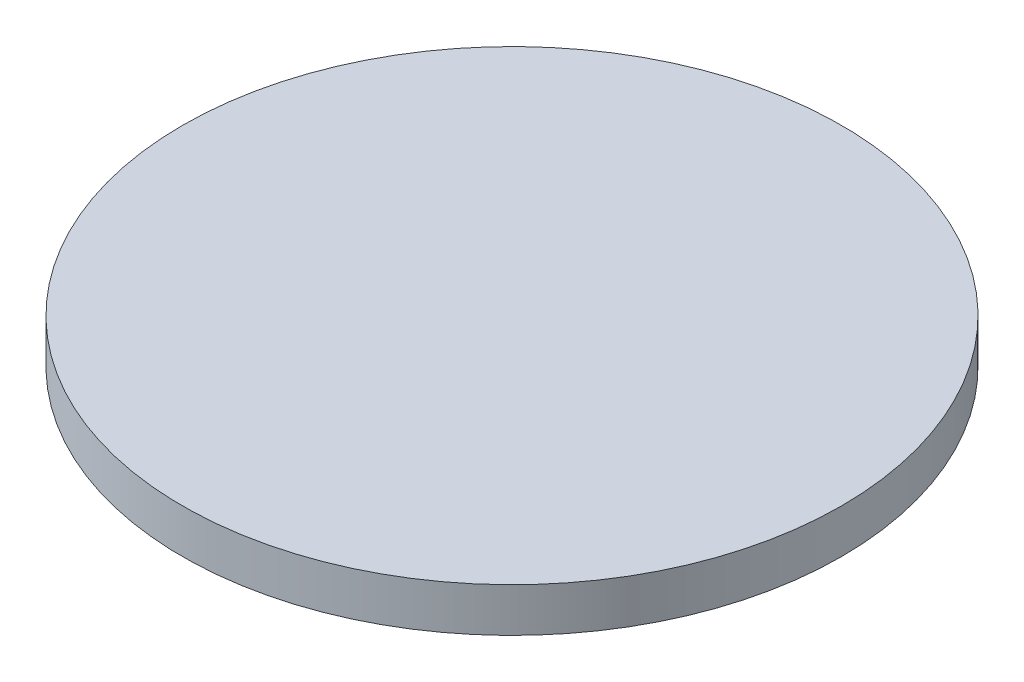
ISO-10303-21;
HEADER;
FILE_DESCRIPTION(('STEP AP214'),'2;1');
FILE_NAME('part.step','',(''),(''),'','','');
FILE_SCHEMA(('AUTOMOTIVE_DESIGN { 1 0 10303 214 1 1 1 1 }'));
ENDSEC;
DATA;
#1=APPLICATION_CONTEXT('core data for automotive mechanical design processes');
#2=APPLICATION_PROTOCOL_DEFINITION('international standard','automotive_design',2000,#1);
#3=PRODUCT_CONTEXT('',#1,'mechanical');
#4=PRODUCT('Part','Part','',(#3));
#5=PRODUCT_RELATED_PRODUCT_CATEGORY('part','',(#4));
#6=PRODUCT_DEFINITION_FORMATION('','',#4);
#7=PRODUCT_DEFINITION_CONTEXT('part definition',#1,'design');
#8=PRODUCT_DEFINITION('design','',#6,#7);
#9=PRODUCT_DEFINITION_SHAPE('','',#8);
#10=(LENGTH_UNIT() NAMED_UNIT(*) SI_UNIT(.MILLI.,.METRE.));
#11=(NAMED_UNIT(*) PLANE_ANGLE_UNIT() SI_UNIT($,.RADIAN.));
#12=(NAMED_UNIT(*) SI_UNIT($,.STERADIAN.) SOLID_ANGLE_UNIT());
#13=UNCERTAINTY_MEASURE_WITH_UNIT(LENGTH_MEASURE(1.E-05),#10,'distance_accuracy_value','');
#14=(GEOMETRIC_REPRESENTATION_CONTEXT(3) GLOBAL_UNCERTAINTY_ASSIGNED_CONTEXT((#13)) GLOBAL_UNIT_ASSIGNED_CONTEXT((#10,
#11,#12)) REPRESENTATION_CONTEXT('',''));
#15=CARTESIAN_POINT('',(0.,0.,0.));
#16=DIRECTION('',(0.,0.,1.));
#17=DIRECTION('',(1.,0.,0.));
#18=AXIS2_PLACEMENT_3D('',#15,#16,#17);
#19=CARTESIAN_POINT('',(0.,16.,0.));
#20=DIRECTION('',(0.,-1.,0.));
#21=DIRECTION('',(0.,0.,-1.));
#22=AXIS2_PLACEMENT_3D('',#19,#20,#21);
#23=CYLINDRICAL_SURFACE('',#22,22.5);
#24=CARTESIAN_POINT('',(0.,16.,0.));
#25=DIRECTION('',(0.,-1.,0.));
#26=DIRECTION('',(1.,0.,0.));
#27=AXIS2_PLACEMENT_3D('',#24,#25,#26);
#28=CIRCLE('',#27,22.5);
#29=CARTESIAN_POINT('',(22.5,16.,0.));
#30=VERTEX_POINT('',#29);
#31=EDGE_CURVE('E10',#30,#30,#28,.T.);
#32=ORIENTED_EDGE('',*,*,#31,.T.);
#33=EDGE_LOOP('',(#32));
#34=FACE_BOUND('',#33,.T.);
#35=CARTESIAN_POINT('',(0.,13.,0.));
#36=DIRECTION('',(0.,-1.,0.));
#37=DIRECTION('',(1.,0.,0.));
#38=AXIS2_PLACEMENT_3D('',#35,#36,#37);
#39=CIRCLE('',#38,22.5);
#40=CARTESIAN_POINT('',(22.5,13.,0.));
#41=VERTEX_POINT('',#40);
#42=EDGE_CURVE('E34',#41,#41,#39,.T.);
#43=ORIENTED_EDGE('',*,*,#42,.F.);
#44=EDGE_LOOP('',(#43));
#45=FACE_BOUND('',#44,.T.);
#46=ADVANCED_FACE('F31',(#34,#45),#23,.T.);
#47=CARTESIAN_POINT('',(0.,16.,0.));
#48=DIRECTION('',(0.,-1.,0.));
#49=DIRECTION('',(1.,0.,0.));
#50=AXIS2_PLACEMENT_3D('',#47,#48,#49);
#51=PLANE('',#50);
#52=ORIENTED_EDGE('',*,*,#31,.F.);
#53=EDGE_LOOP('',(#52));
#54=FACE_BOUND('',#53,.T.);
#55=ADVANCED_FACE('F46',(#54),#51,.F.);
#56=CARTESIAN_POINT('',(0.,13.,0.));
#57=DIRECTION('',(0.,-1.,0.));
#58=DIRECTION('',(1.,0.,0.));
#59=AXIS2_PLACEMENT_3D('',#56,#57,#58);
#60=PLANE('',#59);
#61=ORIENTED_EDGE('',*,*,#42,.T.);
#62=EDGE_LOOP('',(#61));
#63=FACE_BOUND('',#62,.T.);
#64=ADVANCED_FACE('F43',(#63),#60,.T.);
#65=CLOSED_SHELL('',(#46,#55,#64));
#66=MANIFOLD_SOLID_BREP('B2',#65);
#67=ADVANCED_BREP_SHAPE_REPRESENTATION('',(#18,#66),#14);
#68=SHAPE_DEFINITION_REPRESENTATION(#9,#67);
ENDSEC;
END-ISO-10303-21;
